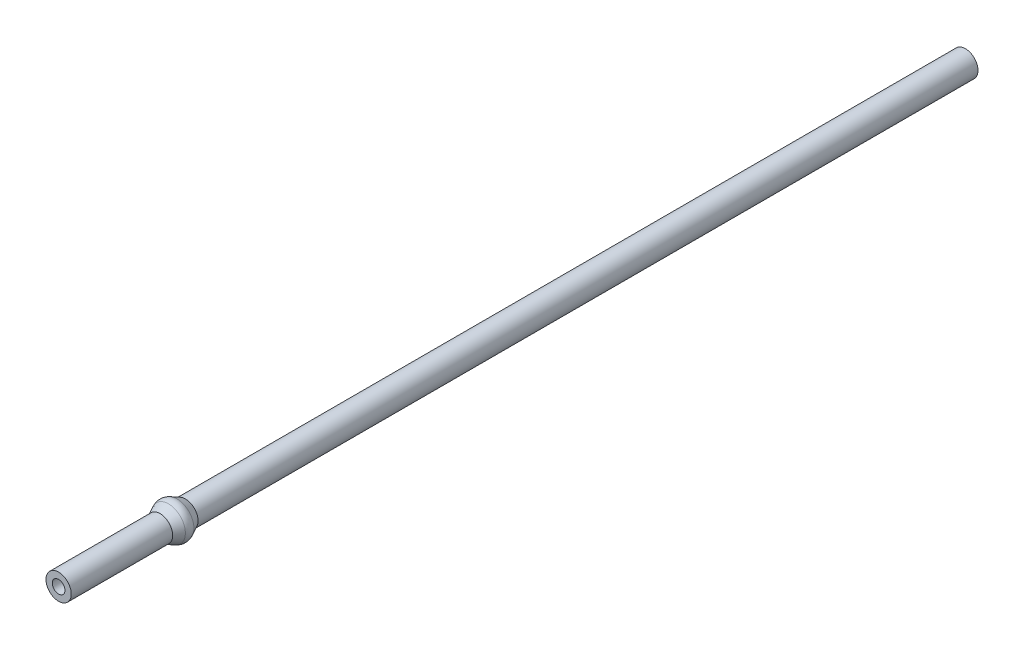
ISO-10303-21;
HEADER;
FILE_DESCRIPTION(('STEP AP214'),'2;1');
FILE_NAME('part.step','',(''),(''),'','','');
FILE_SCHEMA(('AUTOMOTIVE_DESIGN { 1 0 10303 214 1 1 1 1 }'));
ENDSEC;
DATA;
#1=APPLICATION_CONTEXT('core data for automotive mechanical design processes');
#2=APPLICATION_PROTOCOL_DEFINITION('international standard','automotive_design',2000,#1);
#3=PRODUCT_CONTEXT('',#1,'mechanical');
#4=PRODUCT('Part','Part','',(#3));
#5=PRODUCT_RELATED_PRODUCT_CATEGORY('part','',(#4));
#6=PRODUCT_DEFINITION_FORMATION('','',#4);
#7=PRODUCT_DEFINITION_CONTEXT('part definition',#1,'design');
#8=PRODUCT_DEFINITION('design','',#6,#7);
#9=PRODUCT_DEFINITION_SHAPE('','',#8);
#10=(LENGTH_UNIT() NAMED_UNIT(*) SI_UNIT(.MILLI.,.METRE.));
#11=(NAMED_UNIT(*) PLANE_ANGLE_UNIT() SI_UNIT($,.RADIAN.));
#12=(NAMED_UNIT(*) SI_UNIT($,.STERADIAN.) SOLID_ANGLE_UNIT());
#13=UNCERTAINTY_MEASURE_WITH_UNIT(LENGTH_MEASURE(1.E-05),#10,'distance_accuracy_value','');
#14=(GEOMETRIC_REPRESENTATION_CONTEXT(3) GLOBAL_UNCERTAINTY_ASSIGNED_CONTEXT((#13)) GLOBAL_UNIT_ASSIGNED_CONTEXT((#10,
#11,#12)) REPRESENTATION_CONTEXT('',''));
#15=CARTESIAN_POINT('',(0.,0.,0.));
#16=DIRECTION('',(0.,0.,1.));
#17=DIRECTION('',(1.,0.,0.));
#18=AXIS2_PLACEMENT_3D('',#15,#16,#17);
#19=CARTESIAN_POINT('',(0.,0.,-113.50625));
#20=DIRECTION('',(0.,0.,1.));
#21=DIRECTION('',(1.,0.,0.));
#22=AXIS2_PLACEMENT_3D('',#19,#20,#21);
#23=CYLINDRICAL_SURFACE('',#22,1.58242);
#24=CARTESIAN_POINT('',(0.,0.,0.));
#25=DIRECTION('',(0.,0.,1.));
#26=DIRECTION('',(1.,0.,0.));
#27=AXIS2_PLACEMENT_3D('',#24,#25,#26);
#28=CIRCLE('',#27,1.58242);
#29=CARTESIAN_POINT('',(1.58242,0.,0.));
#30=VERTEX_POINT('',#29);
#31=EDGE_CURVE('E38',#30,#30,#28,.T.);
#32=ORIENTED_EDGE('',*,*,#31,.F.);
#33=EDGE_LOOP('',(#32));
#34=FACE_BOUND('',#33,.T.);
#35=CARTESIAN_POINT('',(0.,0.,-12.7));
#36=DIRECTION('',(0.,0.,1.));
#37=DIRECTION('',(1.,0.,0.));
#38=AXIS2_PLACEMENT_3D('',#35,#36,#37);
#39=CIRCLE('',#38,1.58242);
#40=CARTESIAN_POINT('',(1.58242,0.,-12.7));
#41=VERTEX_POINT('',#40);
#42=EDGE_CURVE('E57',#41,#41,#39,.T.);
#43=ORIENTED_EDGE('',*,*,#42,.T.);
#44=EDGE_LOOP('',(#43));
#45=FACE_BOUND('',#44,.T.);
#46=ADVANCED_FACE('F31',(#34,#45),#23,.T.);
#47=CARTESIAN_POINT('',(0.,0.,-113.50625));
#48=DIRECTION('',(0.,0.,1.));
#49=DIRECTION('',(1.,0.,0.));
#50=AXIS2_PLACEMENT_3D('',#47,#48,#49);
#51=CIRCLE('',#50,1.58242);
#52=CARTESIAN_POINT('',(1.58242,0.,-113.50625));
#53=VERTEX_POINT('',#52);
#54=EDGE_CURVE('E10',#53,#53,#51,.T.);
#55=ORIENTED_EDGE('',*,*,#54,.T.);
#56=EDGE_LOOP('',(#55));
#57=FACE_BOUND('',#56,.T.);
#58=CARTESIAN_POINT('',(0.,0.,-15.875));
#59=DIRECTION('',(0.,0.,1.));
#60=DIRECTION('',(1.,0.,0.));
#61=AXIS2_PLACEMENT_3D('',#58,#59,#60);
#62=CIRCLE('',#61,1.58242);
#63=CARTESIAN_POINT('',(1.58242,0.,-15.875));
#64=VERTEX_POINT('',#63);
#65=EDGE_CURVE('E68',#64,#64,#62,.T.);
#66=ORIENTED_EDGE('',*,*,#65,.F.);
#67=EDGE_LOOP('',(#66));
#68=FACE_BOUND('',#67,.T.);
#69=ADVANCED_FACE('F74',(#57,#68),#23,.T.);
#70=CARTESIAN_POINT('',(0.,0.,-113.50625));
#71=DIRECTION('',(0.,0.,1.));
#72=DIRECTION('',(1.,0.,0.));
#73=AXIS2_PLACEMENT_3D('',#70,#71,#72);
#74=PLANE('',#73);
#75=CARTESIAN_POINT('',(0.,0.,-113.50625));
#76=DIRECTION('',(0.,0.,1.));
#77=DIRECTION('',(1.,0.,0.));
#78=AXIS2_PLACEMENT_3D('',#75,#76,#77);
#79=CIRCLE('',#78,0.79375);
#80=CARTESIAN_POINT('',(0.79375,0.,-113.50625));
#81=VERTEX_POINT('',#80);
#82=EDGE_CURVE('E53',#81,#81,#79,.T.);
#83=ORIENTED_EDGE('',*,*,#82,.T.);
#84=EDGE_LOOP('',(#83));
#85=FACE_BOUND('',#84,.T.);
#86=ORIENTED_EDGE('',*,*,#54,.F.);
#87=EDGE_LOOP('',(#86));
#88=FACE_BOUND('',#87,.T.);
#89=ADVANCED_FACE('F76',(#85,#88),#74,.F.);
#90=CARTESIAN_POINT('',(0.,0.,0.));
#91=DIRECTION('',(0.,0.,1.));
#92=DIRECTION('',(1.,0.,0.));
#93=AXIS2_PLACEMENT_3D('',#90,#91,#92);
#94=PLANE('',#93);
#95=CARTESIAN_POINT('',(0.,0.,0.));
#96=DIRECTION('',(0.,0.,1.));
#97=DIRECTION('',(1.,0.,0.));
#98=AXIS2_PLACEMENT_3D('',#95,#96,#97);
#99=CIRCLE('',#98,0.79375);
#100=CARTESIAN_POINT('',(0.79375,0.,0.));
#101=VERTEX_POINT('',#100);
#102=EDGE_CURVE('E45',#101,#101,#99,.T.);
#103=ORIENTED_EDGE('',*,*,#102,.F.);
#104=EDGE_LOOP('',(#103));
#105=FACE_BOUND('',#104,.T.);
#106=ORIENTED_EDGE('',*,*,#31,.T.);
#107=EDGE_LOOP('',(#106));
#108=FACE_BOUND('',#107,.T.);
#109=ADVANCED_FACE('F81',(#105,#108),#94,.T.);
#110=CARTESIAN_POINT('',(0.,0.,-3.17500000000001));
#111=DIRECTION('',(0.,0.,1.));
#112=DIRECTION('',(1.,0.,0.));
#113=AXIS2_PLACEMENT_3D('',#110,#111,#112);
#114=CYLINDRICAL_SURFACE('',#113,0.79375);
#115=CARTESIAN_POINT('',(0.,0.,-3.17500000000001));
#116=DIRECTION('',(0.,0.,1.));
#117=DIRECTION('',(1.,0.,0.));
#118=AXIS2_PLACEMENT_3D('',#115,#116,#117);
#119=CIRCLE('',#118,0.79375);
#120=CARTESIAN_POINT('',(0.79375,0.,-3.17500000000001));
#121=VERTEX_POINT('',#120);
#122=EDGE_CURVE('E43',#121,#121,#119,.T.);
#123=ORIENTED_EDGE('',*,*,#122,.F.);
#124=EDGE_LOOP('',(#123));
#125=FACE_BOUND('',#124,.T.);
#126=ORIENTED_EDGE('',*,*,#102,.T.);
#127=EDGE_LOOP('',(#126));
#128=FACE_BOUND('',#127,.T.);
#129=ADVANCED_FACE('F123',(#125,#128),#114,.F.);
#130=CARTESIAN_POINT('',(0.,0.,-3.17500000000001));
#131=DIRECTION('',(0.,0.,1.));
#132=DIRECTION('',(1.,0.,0.));
#133=AXIS2_PLACEMENT_3D('',#130,#131,#132);
#134=PLANE('',#133);
#135=CARTESIAN_POINT('',(0.,0.,-3.17500000000001));
#136=DIRECTION('',(0.,0.,1.));
#137=DIRECTION('',(1.,0.,0.));
#138=AXIS2_PLACEMENT_3D('',#135,#136,#137);
#139=CIRCLE('',#138,0.396875);
#140=CARTESIAN_POINT('',(0.396875,0.,-3.17500000000001));
#141=VERTEX_POINT('',#140);
#142=EDGE_CURVE('E34',#141,#141,#139,.T.);
#143=ORIENTED_EDGE('',*,*,#142,.F.);
#144=EDGE_LOOP('',(#143));
#145=FACE_BOUND('',#144,.T.);
#146=ORIENTED_EDGE('',*,*,#122,.T.);
#147=EDGE_LOOP('',(#146));
#148=FACE_BOUND('',#147,.T.);
#149=ADVANCED_FACE('F119',(#145,#148),#134,.T.);
#150=CARTESIAN_POINT('',(0.,0.,-14.2875));
#151=DIRECTION('',(0.,0.,1.));
#152=DIRECTION('',(1.,0.,0.));
#153=AXIS2_PLACEMENT_3D('',#150,#151,#152);
#154=CYLINDRICAL_SURFACE('',#153,0.396875);
#155=ORIENTED_EDGE('',*,*,#142,.T.);
#156=EDGE_LOOP('',(#155));
#157=FACE_BOUND('',#156,.T.);
#158=CARTESIAN_POINT('',(0.,0.,-14.2875));
#159=DIRECTION('',(0.,0.,1.));
#160=DIRECTION('',(1.,0.,0.));
#161=AXIS2_PLACEMENT_3D('',#158,#159,#160);
#162=CIRCLE('',#161,0.396875);
#163=CARTESIAN_POINT('',(0.396875,0.,-14.2875));
#164=VERTEX_POINT('',#163);
#165=EDGE_CURVE('E50',#164,#164,#162,.T.);
#166=ORIENTED_EDGE('',*,*,#165,.F.);
#167=EDGE_LOOP('',(#166));
#168=FACE_BOUND('',#167,.T.);
#169=ADVANCED_FACE('F115',(#157,#168),#154,.F.);
#170=CARTESIAN_POINT('',(0.,0.,-113.50625));
#171=DIRECTION('',(0.,0.,1.));
#172=DIRECTION('',(1.,0.,0.));
#173=AXIS2_PLACEMENT_3D('',#170,#171,#172);
#174=CYLINDRICAL_SURFACE('',#173,0.79375);
#175=ORIENTED_EDGE('',*,*,#82,.F.);
#176=EDGE_LOOP('',(#175));
#177=FACE_BOUND('',#176,.T.);
#178=CARTESIAN_POINT('',(0.,0.,-14.2875));
#179=DIRECTION('',(0.,0.,1.));
#180=DIRECTION('',(1.,0.,0.));
#181=AXIS2_PLACEMENT_3D('',#178,#179,#180);
#182=CIRCLE('',#181,0.79375);
#183=CARTESIAN_POINT('',(0.79375,0.,-14.2875));
#184=VERTEX_POINT('',#183);
#185=EDGE_CURVE('E54',#184,#184,#182,.T.);
#186=ORIENTED_EDGE('',*,*,#185,.T.);
#187=EDGE_LOOP('',(#186));
#188=FACE_BOUND('',#187,.T.);
#189=ADVANCED_FACE('F111',(#177,#188),#174,.F.);
#190=CARTESIAN_POINT('',(0.,0.,-14.2875));
#191=DIRECTION('',(0.,0.,1.));
#192=DIRECTION('',(1.,0.,0.));
#193=AXIS2_PLACEMENT_3D('',#190,#191,#192);
#194=PLANE('',#193);
#195=ORIENTED_EDGE('',*,*,#165,.T.);
#196=EDGE_LOOP('',(#195));
#197=FACE_BOUND('',#196,.T.);
#198=ORIENTED_EDGE('',*,*,#185,.F.);
#199=EDGE_LOOP('',(#198));
#200=FACE_BOUND('',#199,.T.);
#201=ADVANCED_FACE('F95',(#197,#200),#194,.F.);
#202=CARTESIAN_POINT('',(0.,0.,-13.7520299012598));
#203=DIRECTION('',(0.,0.,-1.));
#204=DIRECTION('',(-1.,0.,0.));
#205=AXIS2_PLACEMENT_3D('',#202,#203,#204);
#206=CONICAL_SURFACE('',#205,2.11180144631396,0.466204330818787);
#207=ORIENTED_EDGE('',*,*,#42,.F.);
#208=EDGE_LOOP('',(#207));
#209=FACE_BOUND('',#208,.T.);
#210=CARTESIAN_POINT('',(0.,0.,-13.7520299012598));
#211=DIRECTION('',(0.,0.,1.));
#212=DIRECTION('',(1.,0.,0.));
#213=AXIS2_PLACEMENT_3D('',#210,#211,#212);
#214=CIRCLE('',#213,2.11180144631396);
#215=CARTESIAN_POINT('',(2.11180144631396,0.,-13.7520299012598));
#216=VERTEX_POINT('',#215);
#217=EDGE_CURVE('E62',#216,#216,#214,.T.);
#218=ORIENTED_EDGE('',*,*,#217,.T.);
#219=EDGE_LOOP('',(#218));
#220=FACE_BOUND('',#219,.T.);
#221=ADVANCED_FACE('F91',(#209,#220),#206,.T.);
#222=CARTESIAN_POINT('',(0.,0.,-14.2875));
#223=DIRECTION('',(0.,0.,1.));
#224=DIRECTION('',(1.,0.,0.));
#225=AXIS2_PLACEMENT_3D('',#222,#223,#224);
#226=DEGENERATE_TOROIDAL_SURFACE('',#225,1.04767167934227,1.19126,.T.);
#227=ORIENTED_EDGE('',*,*,#217,.F.);
#228=EDGE_LOOP('',(#227));
#229=FACE_BOUND('',#228,.T.);
#230=CARTESIAN_POINT('',(0.,0.,-14.8229700987401));
#231=DIRECTION('',(0.,0.,1.));
#232=DIRECTION('',(1.,0.,0.));
#233=AXIS2_PLACEMENT_3D('',#230,#231,#232);
#234=CIRCLE('',#233,2.11180144631396);
#235=CARTESIAN_POINT('',(2.11180144631396,0.,-14.8229700987401));
#236=VERTEX_POINT('',#235);
#237=EDGE_CURVE('E65',#236,#236,#234,.T.);
#238=ORIENTED_EDGE('',*,*,#237,.T.);
#239=EDGE_LOOP('',(#238));
#240=FACE_BOUND('',#239,.T.);
#241=ADVANCED_FACE('F94',(#229,#240),#226,.T.);
#242=CARTESIAN_POINT('',(0.,0.,-15.875));
#243=DIRECTION('',(0.,0.,1.));
#244=DIRECTION('',(1.,0.,0.));
#245=AXIS2_PLACEMENT_3D('',#242,#243,#244);
#246=CONICAL_SURFACE('',#245,1.58242,0.466204330818786);
#247=ORIENTED_EDGE('',*,*,#237,.F.);
#248=EDGE_LOOP('',(#247));
#249=FACE_BOUND('',#248,.T.);
#250=ORIENTED_EDGE('',*,*,#65,.T.);
#251=EDGE_LOOP('',(#250));
#252=FACE_BOUND('',#251,.T.);
#253=ADVANCED_FACE('F72',(#249,#252),#246,.T.);
#254=CLOSED_SHELL('',(#46,#69,#89,#109,#129,#149,#169,#189,#201,#221,#241,#253));
#255=MANIFOLD_SOLID_BREP('B2',#254);
#256=ADVANCED_BREP_SHAPE_REPRESENTATION('',(#18,#255),#14);
#257=SHAPE_DEFINITION_REPRESENTATION(#9,#256);
ENDSEC;
END-ISO-10303-21;
